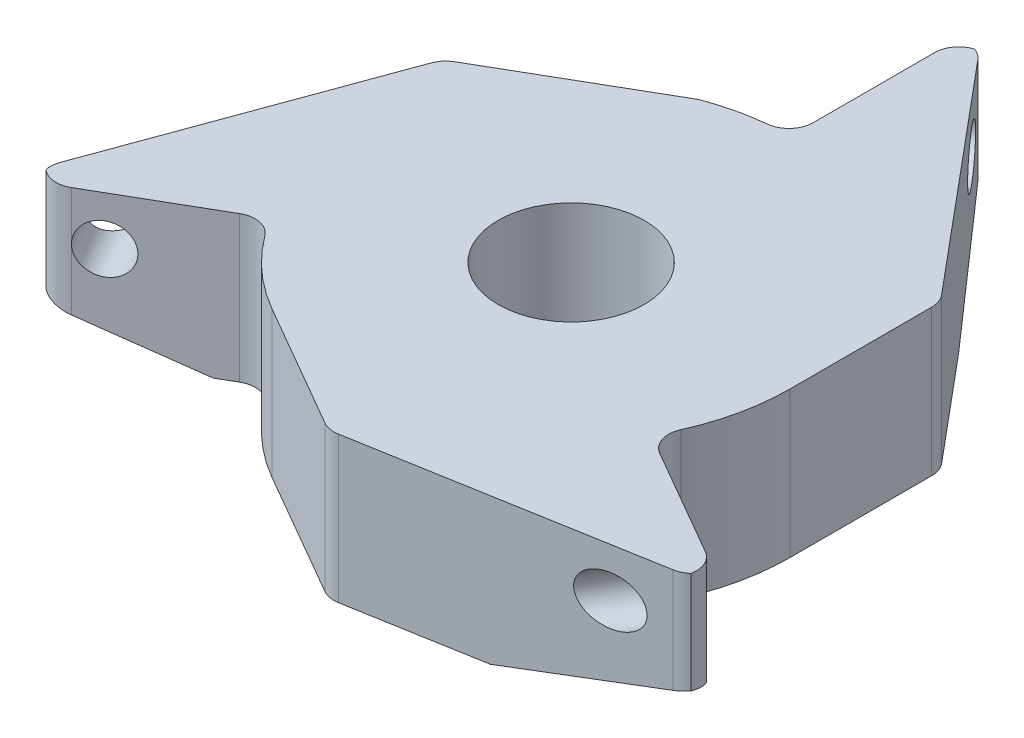
ISO-10303-21;
HEADER;
FILE_DESCRIPTION(('STEP AP214'),'2;1');
FILE_NAME('part.step','',(''),(''),'','','');
FILE_SCHEMA(('AUTOMOTIVE_DESIGN { 1 0 10303 214 1 1 1 1 }'));
ENDSEC;
DATA;
#1=APPLICATION_CONTEXT('core data for automotive mechanical design processes');
#2=APPLICATION_PROTOCOL_DEFINITION('international standard','automotive_design',2000,#1);
#3=PRODUCT_CONTEXT('',#1,'mechanical');
#4=PRODUCT('Part','Part','',(#3));
#5=PRODUCT_RELATED_PRODUCT_CATEGORY('part','',(#4));
#6=PRODUCT_DEFINITION_FORMATION('','',#4);
#7=PRODUCT_DEFINITION_CONTEXT('part definition',#1,'design');
#8=PRODUCT_DEFINITION('design','',#6,#7);
#9=PRODUCT_DEFINITION_SHAPE('','',#8);
#10=(LENGTH_UNIT() NAMED_UNIT(*) SI_UNIT(.MILLI.,.METRE.));
#11=(NAMED_UNIT(*) PLANE_ANGLE_UNIT() SI_UNIT($,.RADIAN.));
#12=(NAMED_UNIT(*) SI_UNIT($,.STERADIAN.) SOLID_ANGLE_UNIT());
#13=UNCERTAINTY_MEASURE_WITH_UNIT(LENGTH_MEASURE(1.E-05),#10,'distance_accuracy_value','');
#14=(GEOMETRIC_REPRESENTATION_CONTEXT(3) GLOBAL_UNCERTAINTY_ASSIGNED_CONTEXT((#13)) GLOBAL_UNIT_ASSIGNED_CONTEXT((#10,
#11,#12)) REPRESENTATION_CONTEXT('',''));
#15=CARTESIAN_POINT('',(0.,0.,0.));
#16=DIRECTION('',(0.,0.,1.));
#17=DIRECTION('',(1.,0.,0.));
#18=AXIS2_PLACEMENT_3D('',#15,#16,#17);
#19=CARTESIAN_POINT('',(1.15585107942412,6.,9.90493523888265));
#20=DIRECTION('',(0.,-1.,0.));
#21=DIRECTION('',(0.,0.,-1.));
#22=AXIS2_PLACEMENT_3D('',#19,#20,#21);
#23=PLANE('',#22);
#24=CARTESIAN_POINT('',(1.15585107942412,6.,9.90493523888265));
#25=DIRECTION('',(0.,1.,0.));
#26=DIRECTION('',(0.,0.,-1.));
#27=AXIS2_PLACEMENT_3D('',#24,#25,#26);
#28=CIRCLE('',#27,1.);
#29=CARTESIAN_POINT('',(0.655851079424115,6.,10.7709606426671));
#30=VERTEX_POINT('',#29);
#31=CARTESIAN_POINT('',(1.32807347289461,6.,10.8899933321885));
#32=VERTEX_POINT('',#31);
#33=EDGE_CURVE('E343',#30,#32,#28,.T.);
#34=ORIENTED_EDGE('',*,*,#33,.T.);
#35=DIRECTION('',(0.985058093305819,0.,-0.172222393470493));
#36=VECTOR('',#35,1.);
#37=CARTESIAN_POINT('',(13.0349088668718,6.,8.84323159781235));
#38=LINE('',#37,#36);
#39=CARTESIAN_POINT('',(13.0349088668718,6.,8.84323159781235));
#40=VERTEX_POINT('',#39);
#41=EDGE_CURVE('E346',#32,#40,#38,.T.);
#42=ORIENTED_EDGE('',*,*,#41,.T.);
#43=CARTESIAN_POINT('',(12.8626864734013,6.,7.85817350450654));
#44=DIRECTION('',(0.,1.,0.));
#45=DIRECTION('',(0.,0.,-1.));
#46=AXIS2_PLACEMENT_3D('',#43,#44,#45);
#47=CIRCLE('',#46,0.999999999999999);
#48=CARTESIAN_POINT('',(13.5287104129548,6.,8.60410387119081));
#49=VERTEX_POINT('',#48);
#50=EDGE_CURVE('E349',#40,#49,#47,.T.);
#51=ORIENTED_EDGE('',*,*,#50,.T.);
#52=CARTESIAN_POINT('',(12.5497037961752,6.,8.40027540335109));
#53=DIRECTION('',(0.,1.,0.));
#54=DIRECTION('',(0.,0.,-1.));
#55=AXIS2_PLACEMENT_3D('',#52,#53,#54);
#56=CIRCLE('',#55,1.);
#57=CARTESIAN_POINT('',(13.0497037961752,6.,7.53424999956666));
#58=VERTEX_POINT('',#57);
#59=EDGE_CURVE('E351',#49,#58,#56,.T.);
#60=ORIENTED_EDGE('',*,*,#59,.T.);
#61=DIRECTION('',(-0.866025403784439,0.,-0.5));
#62=VECTOR('',#61,1.);
#63=CARTESIAN_POINT('',(8.61684396980704,6.,4.9749371855331));
#64=LINE('',#63,#62);
#65=CARTESIAN_POINT('',(8.61684396980704,6.,4.9749371855331));
#66=VERTEX_POINT('',#65);
#67=EDGE_CURVE('E353',#58,#66,#64,.T.);
#68=ORIENTED_EDGE('',*,*,#67,.T.);
#69=CARTESIAN_POINT('',(9.11684396980704,6.,4.10891178174866));
#70=DIRECTION('',(0.,-1.,0.));
#71=DIRECTION('',(0.,0.,1.));
#72=AXIS2_PLACEMENT_3D('',#69,#70,#71);
#73=CIRCLE('',#72,0.999999999999998);
#74=CARTESIAN_POINT('',(8.20515957282634,6.,3.6980206035738));
#75=VERTEX_POINT('',#74);
#76=EDGE_CURVE('E355',#66,#75,#73,.T.);
#77=ORIENTED_EDGE('',*,*,#76,.T.);
#78=CARTESIAN_POINT('',(0.,6.,0.));
#79=DIRECTION('',(0.,1.,0.));
#80=DIRECTION('',(0.,0.,1.));
#81=AXIS2_PLACEMENT_3D('',#78,#79,#80);
#82=CIRCLE('',#81,9.);
#83=CARTESIAN_POINT('',(9.,6.,0.));
#84=VERTEX_POINT('',#83);
#85=EDGE_CURVE('E357',#75,#84,#82,.T.);
#86=ORIENTED_EDGE('',*,*,#85,.T.);
#87=DIRECTION('',(0.,0.,-1.));
#88=VECTOR('',#87,1.);
#89=CARTESIAN_POINT('',(9.,6.,-5.81646401894767));
#90=LINE('',#89,#88);
#91=CARTESIAN_POINT('',(9.,6.,-5.81646401894767));
#92=VERTEX_POINT('',#91);
#93=EDGE_CURVE('E359',#84,#92,#90,.T.);
#94=ORIENTED_EDGE('',*,*,#93,.T.);
#95=CARTESIAN_POINT('',(8.,6.,-5.81646401894767));
#96=DIRECTION('',(0.,1.,0.));
#97=DIRECTION('',(0.,0.,-1.));
#98=AXIS2_PLACEMENT_3D('',#95,#96,#97);
#99=CIRCLE('',#98,0.999999999999999);
#100=CARTESIAN_POINT('',(8.76697413627105,6.,-6.45814203344659));
#101=VERTEX_POINT('',#100);
#102=EDGE_CURVE('E361',#92,#101,#99,.T.);
#103=ORIENTED_EDGE('',*,*,#102,.T.);
#104=DIRECTION('',(-0.641678014498915,0.,-0.766974136271054));
#105=VECTOR('',#104,1.);
#106=CARTESIAN_POINT('',(1.14100878181883,6.,-15.5731780153656));
#107=LINE('',#106,#105);
#108=CARTESIAN_POINT('',(1.14100878181883,6.,-15.5731780153656));
#109=VERTEX_POINT('',#108);
#110=EDGE_CURVE('E363',#101,#109,#107,.T.);
#111=ORIENTED_EDGE('',*,*,#110,.T.);
#112=CARTESIAN_POINT('',(0.37403464554778,6.,-14.9315000008667));
#113=DIRECTION('',(0.,1.,0.));
#114=DIRECTION('',(0.,0.,-1.));
#115=AXIS2_PLACEMENT_3D('',#112,#113,#114);
#116=CIRCLE('',#115,1.);
#117=CARTESIAN_POINT('',(0.687017322773891,6.,-15.8812588353907));
#118=VERTEX_POINT('',#117);
#119=EDGE_CURVE('E365',#109,#118,#116,.T.);
#120=ORIENTED_EDGE('',*,*,#119,.T.);
#121=CARTESIAN_POINT('',(1.,6.,-14.9315000008667));
#122=DIRECTION('',(0.,1.,0.));
#123=DIRECTION('',(0.,0.,-1.));
#124=AXIS2_PLACEMENT_3D('',#121,#122,#123);
#125=CIRCLE('',#124,1.);
#126=CARTESIAN_POINT('',(0.,6.,-14.9315000008667));
#127=VERTEX_POINT('',#126);
#128=EDGE_CURVE('E367',#118,#127,#125,.T.);
#129=ORIENTED_EDGE('',*,*,#128,.T.);
#130=DIRECTION('',(0.,0.,1.));
#131=VECTOR('',#130,1.);
#132=CARTESIAN_POINT('',(0.,6.,-9.9498743710662));
#133=LINE('',#132,#131);
#134=CARTESIAN_POINT('',(0.,6.,-9.9498743710662));
#135=VERTEX_POINT('',#134);
#136=EDGE_CURVE('E369',#127,#135,#133,.T.);
#137=ORIENTED_EDGE('',*,*,#136,.T.);
#138=CARTESIAN_POINT('',(-1.,6.,-9.9498743710662));
#139=DIRECTION('',(0.,-1.,0.));
#140=DIRECTION('',(0.,0.,-1.));
#141=AXIS2_PLACEMENT_3D('',#138,#139,#140);
#142=CIRCLE('',#141,1.);
#143=CARTESIAN_POINT('',(-0.9,6.,-8.95488693395958));
#144=VERTEX_POINT('',#143);
#145=EDGE_CURVE('E371',#135,#144,#142,.T.);
#146=ORIENTED_EDGE('',*,*,#145,.T.);
#147=CARTESIAN_POINT('',(0.,6.,0.));
#148=DIRECTION('',(0.,1.,0.));
#149=DIRECTION('',(0.,0.,1.));
#150=AXIS2_PLACEMENT_3D('',#147,#148,#149);
#151=CIRCLE('',#150,9.);
#152=CARTESIAN_POINT('',(-3.17926677950252,6.,-8.41975431617524));
#153=VERTEX_POINT('',#152);
#154=EDGE_CURVE('E373',#144,#153,#151,.T.);
#155=ORIENTED_EDGE('',*,*,#154,.T.);
#156=DIRECTION('',(-0.866025403784439,0.,0.499999999999999));
#157=VECTOR('',#156,1.);
#158=CARTESIAN_POINT('',(-9.53720560060681,6.,-4.74899662631952));
#159=LINE('',#158,#157);
#160=CARTESIAN_POINT('',(-9.53720560060681,6.,-4.74899662631952));
#161=VERTEX_POINT('',#160);
#162=EDGE_CURVE('E375',#153,#161,#159,.T.);
#163=ORIENTED_EDGE('',*,*,#162,.T.);
#164=CARTESIAN_POINT('',(-9.03720560060681,6.,-3.88297122253508));
#165=DIRECTION('',(0.,1.,0.));
#166=DIRECTION('',(0.,0.,1.));
#167=AXIS2_PLACEMENT_3D('',#164,#165,#166);
#168=CIRCLE('',#167,1.);
#169=CARTESIAN_POINT('',(-9.97640213034836,6.,-4.22635130134199));
#170=VERTEX_POINT('',#169);
#171=EDGE_CURVE('E377',#161,#170,#168,.T.);
#172=ORIENTED_EDGE('',*,*,#171,.T.);
#173=DIRECTION('',(-0.343380078806903,0.,0.939196529741547));
#174=VECTOR('',#173,1.);
#175=CARTESIAN_POINT('',(-14.0572721698734,6.,6.93544641495316));
#176=LINE('',#175,#174);
#177=CARTESIAN_POINT('',(-14.0572721698734,6.,6.93544641495316));
#178=VERTEX_POINT('',#177);
#179=EDGE_CURVE('E379',#170,#178,#176,.T.);
#180=ORIENTED_EDGE('',*,*,#179,.T.);
#181=CARTESIAN_POINT('',(-13.1180756401318,6.,7.27882649376006));
#182=DIRECTION('',(0.,1.,0.));
#183=DIRECTION('',(0.,0.,1.));
#184=AXIS2_PLACEMENT_3D('',#181,#182,#183);
#185=CIRCLE('',#184,1.);
#186=CARTESIAN_POINT('',(-14.0970822569114,6.,7.48265496159978));
#187=VERTEX_POINT('',#186);
#188=EDGE_CURVE('E381',#178,#187,#185,.T.);
#189=ORIENTED_EDGE('',*,*,#188,.T.);
#190=CARTESIAN_POINT('',(-13.4310583173579,6.,6.73672459491551));
#191=DIRECTION('',(0.,1.,0.));
#192=DIRECTION('',(0.,0.,-1.));
#193=AXIS2_PLACEMENT_3D('',#190,#191,#192);
#194=CIRCLE('',#193,1.);
#195=CARTESIAN_POINT('',(-12.9310583173579,6.,7.60274999869994));
#196=VERTEX_POINT('',#195);
#197=EDGE_CURVE('E383',#187,#196,#194,.T.);
#198=ORIENTED_EDGE('',*,*,#197,.T.);
#199=DIRECTION('',(0.866025403784439,0.,-0.5));
#200=VECTOR('',#199,1.);
#201=CARTESIAN_POINT('',(-8.54657490229853,6.,5.07136731875795));
#202=LINE('',#201,#200);
#203=CARTESIAN_POINT('',(-8.54657490229853,6.,5.07136731875795));
#204=VERTEX_POINT('',#203);
#205=EDGE_CURVE('E385',#196,#204,#202,.T.);
#206=ORIENTED_EDGE('',*,*,#205,.T.);
#207=CARTESIAN_POINT('',(-8.04657490229853,6.,5.93739272254239));
#208=DIRECTION('',(0.,-1.,0.));
#209=DIRECTION('',(0.,0.,1.));
#210=AXIS2_PLACEMENT_3D('',#207,#208,#209);
#211=CIRCLE('',#210,0.999999999999999);
#212=CARTESIAN_POINT('',(-7.24191741206868,6.,5.34365345028815));
#213=VERTEX_POINT('',#212);
#214=EDGE_CURVE('E387',#204,#213,#211,.T.);
#215=ORIENTED_EDGE('',*,*,#214,.T.);
#216=CARTESIAN_POINT('',(0.,6.,0.));
#217=DIRECTION('',(0.,1.,0.));
#218=DIRECTION('',(0.,0.,1.));
#219=AXIS2_PLACEMENT_3D('',#216,#217,#218);
#220=CIRCLE('',#219,9.);
#221=CARTESIAN_POINT('',(-4.50000000000001,6.,7.79422863405994));
#222=VERTEX_POINT('',#221);
#223=EDGE_CURVE('E389',#213,#222,#220,.T.);
#224=ORIENTED_EDGE('',*,*,#223,.T.);
#225=DIRECTION('',(0.866025403784439,0.,0.5));
#226=VECTOR('',#225,1.);
#227=CARTESIAN_POINT('',(0.655851079424115,6.,10.7709606426671));
#228=LINE('',#227,#226);
#229=EDGE_CURVE('E391',#222,#30,#228,.T.);
#230=ORIENTED_EDGE('',*,*,#229,.T.);
#231=EDGE_LOOP('',(#34,#42,#51,#60,#68,#77,#86,#94,#103,#111,#120,#129,#137,#146,#155,#163,#172,
#180,#189,#198,#206,#215,#224,#230));
#232=FACE_BOUND('',#231,.T.);
#233=CARTESIAN_POINT('',(0.,6.,0.));
#234=DIRECTION('',(0.,1.,0.));
#235=DIRECTION('',(0.,0.,1.));
#236=AXIS2_PLACEMENT_3D('',#233,#234,#235);
#237=CIRCLE('',#236,3.);
#238=CARTESIAN_POINT('',(0.,6.,3.));
#239=VERTEX_POINT('',#238);
#240=EDGE_CURVE('E337',#239,#239,#237,.T.);
#241=ORIENTED_EDGE('',*,*,#240,.F.);
#242=EDGE_LOOP('',(#241));
#243=FACE_BOUND('',#242,.T.);
#244=ADVANCED_FACE('F38',(#232,#243),#23,.F.);
#245=CARTESIAN_POINT('',(1.15585107942412,0.,9.90493523888265));
#246=DIRECTION('',(0.,-1.,0.));
#247=DIRECTION('',(0.,0.,-1.));
#248=AXIS2_PLACEMENT_3D('',#245,#246,#247);
#249=PLANE('',#248);
#250=DIRECTION('',(0.499999999999996,0.,-0.866025403784441));
#251=VECTOR('',#250,1.);
#252=CARTESIAN_POINT('',(5.29382364628165,0.,12.2939948142571));
#253=LINE('',#252,#251);
#254=CARTESIAN_POINT('',(6.64068393269008,0.,9.9611643675009));
#255=VERTEX_POINT('',#254);
#256=CARTESIAN_POINT('',(9.2938236462816,0.,5.36579158398159));
#257=VERTEX_POINT('',#256);
#258=EDGE_CURVE('E53',#255,#257,#253,.T.);
#259=ORIENTED_EDGE('',*,*,#258,.F.);
#260=DIRECTION('',(0.985058093305819,0.,-0.172222393470493));
#261=VECTOR('',#260,1.);
#262=CARTESIAN_POINT('',(13.0349088668718,0.,8.84323159781235));
#263=LINE('',#262,#261);
#264=CARTESIAN_POINT('',(1.32807347289461,0.,10.8899933321885));
#265=VERTEX_POINT('',#264);
#266=EDGE_CURVE('E396',#265,#255,#263,.T.);
#267=ORIENTED_EDGE('',*,*,#266,.F.);
#268=CARTESIAN_POINT('',(1.15585107942412,0.,9.90493523888265));
#269=DIRECTION('',(0.,1.,0.));
#270=DIRECTION('',(0.,0.,-1.));
#271=AXIS2_PLACEMENT_3D('',#268,#269,#270);
#272=CIRCLE('',#271,1.);
#273=CARTESIAN_POINT('',(0.655851079424115,0.,10.7709606426671));
#274=VERTEX_POINT('',#273);
#275=EDGE_CURVE('E340',#274,#265,#272,.T.);
#276=ORIENTED_EDGE('',*,*,#275,.F.);
#277=DIRECTION('',(0.866025403784439,0.,0.5));
#278=VECTOR('',#277,1.);
#279=CARTESIAN_POINT('',(0.655851079424115,0.,10.7709606426671));
#280=LINE('',#279,#278);
#281=CARTESIAN_POINT('',(-4.50000000000001,0.,7.79422863405994));
#282=VERTEX_POINT('',#281);
#283=EDGE_CURVE('E347',#282,#274,#280,.T.);
#284=ORIENTED_EDGE('',*,*,#283,.F.);
#285=CARTESIAN_POINT('',(0.,0.,0.));
#286=DIRECTION('',(0.,1.,0.));
#287=DIRECTION('',(0.,0.,1.));
#288=AXIS2_PLACEMENT_3D('',#285,#286,#287);
#289=CIRCLE('',#288,9.);
#290=CARTESIAN_POINT('',(-7.24191741206868,0.,5.34365345028815));
#291=VERTEX_POINT('',#290);
#292=EDGE_CURVE('E429',#291,#282,#289,.T.);
#293=ORIENTED_EDGE('',*,*,#292,.F.);
#294=CARTESIAN_POINT('',(-8.04657490229853,0.,5.93739272254239));
#295=DIRECTION('',(0.,-1.,0.));
#296=DIRECTION('',(0.,0.,1.));
#297=AXIS2_PLACEMENT_3D('',#294,#295,#296);
#298=CIRCLE('',#297,0.999999999999999);
#299=CARTESIAN_POINT('',(-8.54657490229853,0.,5.07136731875795));
#300=VERTEX_POINT('',#299);
#301=EDGE_CURVE('E427',#300,#291,#298,.T.);
#302=ORIENTED_EDGE('',*,*,#301,.F.);
#303=DIRECTION('',(0.866025403784439,0.,-0.5));
#304=VECTOR('',#303,1.);
#305=CARTESIAN_POINT('',(-8.54657490229853,0.,5.07136731875795));
#306=LINE('',#305,#304);
#307=CARTESIAN_POINT('',(-9.23450090687295,0.,5.46854158268154));
#308=VERTEX_POINT('',#307);
#309=EDGE_CURVE('E425',#308,#300,#306,.T.);
#310=ORIENTED_EDGE('',*,*,#309,.F.);
#311=DIRECTION('',(0.5,0.,0.866025403784439));
#312=VECTOR('',#311,1.);
#313=CARTESIAN_POINT('',(-4.71589810656955,0.,13.2949912120301));
#314=LINE('',#313,#312);
#315=CARTESIAN_POINT('',(-11.8589858449262,0.,0.922800326274021));
#316=VERTEX_POINT('',#315);
#317=EDGE_CURVE('E331',#316,#308,#314,.T.);
#318=ORIENTED_EDGE('',*,*,#317,.F.);
#319=DIRECTION('',(-0.343380078806903,0.,0.939196529741547));
#320=VECTOR('',#319,1.);
#321=CARTESIAN_POINT('',(-14.0572721698734,0.,6.93544641495316));
#322=LINE('',#321,#320);
#323=CARTESIAN_POINT('',(-9.97640213034836,0.,-4.22635130134199));
#324=VERTEX_POINT('',#323);
#325=EDGE_CURVE('E422',#324,#316,#322,.T.);
#326=ORIENTED_EDGE('',*,*,#325,.F.);
#327=CARTESIAN_POINT('',(-9.03720560060681,0.,-3.88297122253508));
#328=DIRECTION('',(0.,1.,0.));
#329=DIRECTION('',(0.,0.,1.));
#330=AXIS2_PLACEMENT_3D('',#327,#328,#329);
#331=CIRCLE('',#330,1.);
#332=CARTESIAN_POINT('',(-9.53720560060681,0.,-4.74899662631952));
#333=VERTEX_POINT('',#332);
#334=EDGE_CURVE('E420',#333,#324,#331,.T.);
#335=ORIENTED_EDGE('',*,*,#334,.F.);
#336=DIRECTION('',(-0.866025403784439,0.,0.499999999999999));
#337=VECTOR('',#336,1.);
#338=CARTESIAN_POINT('',(-9.53720560060681,0.,-4.74899662631952));
#339=LINE('',#338,#337);
#340=CARTESIAN_POINT('',(-3.17926677950252,0.,-8.41975431617524));
#341=VERTEX_POINT('',#340);
#342=EDGE_CURVE('E418',#341,#333,#339,.T.);
#343=ORIENTED_EDGE('',*,*,#342,.F.);
#344=CARTESIAN_POINT('',(0.,0.,0.));
#345=DIRECTION('',(0.,1.,0.));
#346=DIRECTION('',(0.,0.,1.));
#347=AXIS2_PLACEMENT_3D('',#344,#345,#346);
#348=CIRCLE('',#347,9.);
#349=CARTESIAN_POINT('',(-0.9,0.,-8.95488693395958));
#350=VERTEX_POINT('',#349);
#351=EDGE_CURVE('E416',#350,#341,#348,.T.);
#352=ORIENTED_EDGE('',*,*,#351,.F.);
#353=CARTESIAN_POINT('',(-1.,0.,-9.9498743710662));
#354=DIRECTION('',(0.,-1.,0.));
#355=DIRECTION('',(0.,0.,-1.));
#356=AXIS2_PLACEMENT_3D('',#353,#354,#355);
#357=CIRCLE('',#356,1.);
#358=CARTESIAN_POINT('',(0.,0.,-9.9498743710662));
#359=VERTEX_POINT('',#358);
#360=EDGE_CURVE('E414',#359,#350,#357,.T.);
#361=ORIENTED_EDGE('',*,*,#360,.F.);
#362=DIRECTION('',(0.,0.,1.));
#363=VECTOR('',#362,1.);
#364=CARTESIAN_POINT('',(0.,0.,-9.9498743710662));
#365=LINE('',#364,#363);
#366=CARTESIAN_POINT('',(0.,0.,-10.7315831679632));
#367=VERTEX_POINT('',#366);
#368=EDGE_CURVE('E412',#367,#359,#365,.T.);
#369=ORIENTED_EDGE('',*,*,#368,.F.);
#370=DIRECTION('',(-1.,0.,0.));
#371=VECTOR('',#370,1.);
#372=CARTESIAN_POINT('',(1.15585107942393,0.,-10.7315831679632));
#373=LINE('',#372,#371);
#374=CARTESIAN_POINT('',(5.19166032502993,0.,-10.7315831679632));
#375=VERTEX_POINT('',#374);
#376=EDGE_CURVE('E230',#375,#367,#373,.T.);
#377=ORIENTED_EDGE('',*,*,#376,.F.);
#378=DIRECTION('',(-0.641678014498915,0.,-0.766974136271054));
#379=VECTOR('',#378,1.);
#380=CARTESIAN_POINT('',(1.14100878181883,0.,-15.5731780153656));
#381=LINE('',#380,#379);
#382=CARTESIAN_POINT('',(8.76697413627105,0.,-6.45814203344659));
#383=VERTEX_POINT('',#382);
#384=EDGE_CURVE('E409',#383,#375,#381,.T.);
#385=ORIENTED_EDGE('',*,*,#384,.F.);
#386=CARTESIAN_POINT('',(8.,0.,-5.81646401894767));
#387=DIRECTION('',(0.,1.,0.));
#388=DIRECTION('',(0.,0.,-1.));
#389=AXIS2_PLACEMENT_3D('',#386,#387,#388);
#390=CIRCLE('',#389,0.999999999999999);
#391=CARTESIAN_POINT('',(9.,0.,-5.81646401894767));
#392=VERTEX_POINT('',#391);
#393=EDGE_CURVE('E407',#392,#383,#390,.T.);
#394=ORIENTED_EDGE('',*,*,#393,.F.);
#395=DIRECTION('',(0.,0.,-1.));
#396=VECTOR('',#395,1.);
#397=CARTESIAN_POINT('',(9.,0.,-5.81646401894767));
#398=LINE('',#397,#396);
#399=CARTESIAN_POINT('',(9.,0.,0.));
#400=VERTEX_POINT('',#399);
#401=EDGE_CURVE('E405',#400,#392,#398,.T.);
#402=ORIENTED_EDGE('',*,*,#401,.F.);
#403=CARTESIAN_POINT('',(0.,0.,0.));
#404=DIRECTION('',(0.,1.,0.));
#405=DIRECTION('',(0.,0.,1.));
#406=AXIS2_PLACEMENT_3D('',#403,#404,#405);
#407=CIRCLE('',#406,9.);
#408=CARTESIAN_POINT('',(8.20515957282634,0.,3.6980206035738));
#409=VERTEX_POINT('',#408);
#410=EDGE_CURVE('E403',#409,#400,#407,.T.);
#411=ORIENTED_EDGE('',*,*,#410,.F.);
#412=CARTESIAN_POINT('',(9.11684396980704,0.,4.10891178174866));
#413=DIRECTION('',(0.,-1.,0.));
#414=DIRECTION('',(0.,0.,1.));
#415=AXIS2_PLACEMENT_3D('',#412,#413,#414);
#416=CIRCLE('',#415,0.999999999999998);
#417=CARTESIAN_POINT('',(8.61684396980704,0.,4.9749371855331));
#418=VERTEX_POINT('',#417);
#419=EDGE_CURVE('E401',#418,#409,#416,.T.);
#420=ORIENTED_EDGE('',*,*,#419,.F.);
#421=DIRECTION('',(-0.866025403784439,0.,-0.5));
#422=VECTOR('',#421,1.);
#423=CARTESIAN_POINT('',(8.61684396980704,0.,4.9749371855331));
#424=LINE('',#423,#422);
#425=EDGE_CURVE('E399',#257,#418,#424,.T.);
#426=ORIENTED_EDGE('',*,*,#425,.F.);
#427=EDGE_LOOP('',(#259,#267,#276,#284,#293,#302,#310,#318,#326,#335,#343,#352,#361,#369,#377,
#385,#394,#402,#411,#420,#426));
#428=FACE_BOUND('',#427,.T.);
#429=CARTESIAN_POINT('',(0.,0.,0.));
#430=DIRECTION('',(0.,1.,0.));
#431=DIRECTION('',(0.,0.,1.));
#432=AXIS2_PLACEMENT_3D('',#429,#430,#431);
#433=CIRCLE('',#432,3.);
#434=CARTESIAN_POINT('',(0.,0.,3.));
#435=VERTEX_POINT('',#434);
#436=EDGE_CURVE('E336',#435,#435,#433,.T.);
#437=ORIENTED_EDGE('',*,*,#436,.T.);
#438=EDGE_LOOP('',(#437));
#439=FACE_BOUND('',#438,.T.);
#440=ADVANCED_FACE('F473',(#428,#439),#249,.T.);
#441=CARTESIAN_POINT('',(1.15585107942412,6.,9.90493523888265));
#442=DIRECTION('',(0.,-1.,0.));
#443=DIRECTION('',(0.,0.,-1.));
#444=AXIS2_PLACEMENT_3D('',#441,#442,#443);
#445=CYLINDRICAL_SURFACE('',#444,1.);
#446=ORIENTED_EDGE('',*,*,#275,.T.);
#447=DIRECTION('',(0.,-1.,0.));
#448=VECTOR('',#447,1.);
#449=CARTESIAN_POINT('',(1.32807347289461,6.,10.8899933321885));
#450=LINE('',#449,#448);
#451=EDGE_CURVE('E284',#32,#265,#450,.T.);
#452=ORIENTED_EDGE('',*,*,#451,.F.);
#453=ORIENTED_EDGE('',*,*,#33,.F.);
#454=DIRECTION('',(0.,-1.,0.));
#455=VECTOR('',#454,1.);
#456=CARTESIAN_POINT('',(0.655851079424115,6.,10.7709606426671));
#457=LINE('',#456,#455);
#458=EDGE_CURVE('E393',#30,#274,#457,.T.);
#459=ORIENTED_EDGE('',*,*,#458,.T.);
#460=EDGE_LOOP('',(#446,#452,#453,#459));
#461=FACE_BOUND('',#460,.T.);
#462=ADVANCED_FACE('F40',(#461),#445,.T.);
#463=CARTESIAN_POINT('',(13.0349088668718,6.,8.84323159781235));
#464=DIRECTION('',(-0.172222393470493,0.,-0.985058093305819));
#465=DIRECTION('',(-0.985058093305819,0.,0.172222393470493));
#466=AXIS2_PLACEMENT_3D('',#463,#464,#465);
#467=PLANE('',#466);
#468=CARTESIAN_POINT('',(10.8384531930045,4.,9.22724839425914));
#469=DIRECTION('',(-0.172222393470493,0.,-0.985058093305819));
#470=DIRECTION('',(0.985058093305819,0.,-0.172222393470493));
#471=AXIS2_PLACEMENT_3D('',#468,#469,#470);
#472=ELLIPSE('',#471,1.30382493060573,1.);
#473=CARTESIAN_POINT('',(12.1227964931516,4.,9.00270054404372));
#474=VERTEX_POINT('',#473);
#475=EDGE_CURVE('E291',#474,#474,#472,.T.);
#476=ORIENTED_EDGE('',*,*,#475,.T.);
#477=EDGE_LOOP('',(#476));
#478=FACE_BOUND('',#477,.T.);
#479=ORIENTED_EDGE('',*,*,#266,.T.);
#480=DIRECTION('',(0.95259370790656,0.254612439127245,-0.166546490501923));
#481=VECTOR('',#480,1.);
#482=CARTESIAN_POINT('',(14.0756405321083,1.98724012018014,8.66127552886008));
#483=LINE('',#482,#481);
#484=CARTESIAN_POINT('',(13.0349088668718,1.70906987239933,8.84323159781235));
#485=VERTEX_POINT('',#484);
#486=EDGE_CURVE('E316',#255,#485,#483,.T.);
#487=ORIENTED_EDGE('',*,*,#486,.T.);
#488=DIRECTION('',(0.,-1.,0.));
#489=VECTOR('',#488,1.);
#490=CARTESIAN_POINT('',(13.0349088668718,6.,8.84323159781235));
#491=LINE('',#490,#489);
#492=EDGE_CURVE('E281',#40,#485,#491,.T.);
#493=ORIENTED_EDGE('',*,*,#492,.F.);
#494=ORIENTED_EDGE('',*,*,#41,.F.);
#495=ORIENTED_EDGE('',*,*,#451,.T.);
#496=EDGE_LOOP('',(#479,#487,#493,#494,#495));
#497=FACE_BOUND('',#496,.T.);
#498=ADVANCED_FACE('F535',(#478,#497),#467,.F.);
#499=CARTESIAN_POINT('',(12.8626864734013,6.,7.85817350450654));
#500=DIRECTION('',(0.,-1.,0.));
#501=DIRECTION('',(0.,0.,-1.));
#502=AXIS2_PLACEMENT_3D('',#499,#500,#501);
#503=CYLINDRICAL_SURFACE('',#502,0.999999999999999);
#504=ORIENTED_EDGE('',*,*,#492,.T.);
#505=CARTESIAN_POINT('',(12.8626864734013,1.48879234503332,7.85817350450654));
#506=DIRECTION('',(-0.28118564096977,0.945822136424123,-0.162342605506152));
#507=DIRECTION('',(-0.819105997604964,-0.324685211012307,-0.472911068212058));
#508=AXIS2_PLACEMENT_3D('',#505,#506,#507);
#509=ELLIPSE('',#508,1.05728123871229,0.999999999999999);
#510=CARTESIAN_POINT('',(13.5287104129548,1.81482895987096,8.60410387119081));
#511=VERTEX_POINT('',#510);
#512=EDGE_CURVE('E313',#485,#511,#509,.T.);
#513=ORIENTED_EDGE('',*,*,#512,.T.);
#514=DIRECTION('',(0.,-1.,0.));
#515=VECTOR('',#514,1.);
#516=CARTESIAN_POINT('',(13.5287104129548,6.,8.60410387119081));
#517=LINE('',#516,#515);
#518=EDGE_CURVE('E278',#49,#511,#517,.T.);
#519=ORIENTED_EDGE('',*,*,#518,.F.);
#520=ORIENTED_EDGE('',*,*,#50,.F.);
#521=EDGE_LOOP('',(#504,#513,#519,#520));
#522=FACE_BOUND('',#521,.T.);
#523=ADVANCED_FACE('F532',(#522),#503,.T.);
#524=CARTESIAN_POINT('',(12.5497037961752,6.,8.40027540335109));
#525=DIRECTION('',(0.,-1.,0.));
#526=DIRECTION('',(0.,0.,-1.));
#527=AXIS2_PLACEMENT_3D('',#524,#525,#526);
#528=CYLINDRICAL_SURFACE('',#527,1.);
#529=ORIENTED_EDGE('',*,*,#518,.T.);
#530=CARTESIAN_POINT('',(12.5497037961752,1.48879234503332,8.40027540335109));
#531=DIRECTION('',(-0.28118564096977,0.945822136424123,-0.162342605506152));
#532=DIRECTION('',(-0.819105997604964,-0.324685211012307,-0.472911068212058));
#533=AXIS2_PLACEMENT_3D('',#530,#531,#532);
#534=ELLIPSE('',#533,1.05728123871229,1.);
#535=CARTESIAN_POINT('',(13.0497037961752,1.48879234503332,7.53424999956665));
#536=VERTEX_POINT('',#535);
#537=EDGE_CURVE('E296',#511,#536,#534,.T.);
#538=ORIENTED_EDGE('',*,*,#537,.T.);
#539=DIRECTION('',(0.,-1.,0.));
#540=VECTOR('',#539,1.);
#541=CARTESIAN_POINT('',(13.0497037961752,6.,7.53424999956666));
#542=LINE('',#541,#540);
#543=EDGE_CURVE('E275',#58,#536,#542,.T.);
#544=ORIENTED_EDGE('',*,*,#543,.F.);
#545=ORIENTED_EDGE('',*,*,#59,.F.);
#546=EDGE_LOOP('',(#529,#538,#544,#545));
#547=FACE_BOUND('',#546,.T.);
#548=ADVANCED_FACE('F527',(#547),#528,.T.);
#549=CARTESIAN_POINT('',(8.61684396980704,6.,4.9749371855331));
#550=DIRECTION('',(-0.5,0.,0.866025403784439));
#551=DIRECTION('',(0.866025403784439,0.,0.5));
#552=AXIS2_PLACEMENT_3D('',#549,#550,#551);
#553=PLANE('',#552);
#554=CARTESIAN_POINT('',(12.1243556529821,4.,7.));
#555=DIRECTION('',(-0.5,0.,0.866025403784439));
#556=DIRECTION('',(0.866025403784439,0.,0.5));
#557=AXIS2_PLACEMENT_3D('',#554,#555,#556);
#558=CIRCLE('',#557,1.);
#559=CARTESIAN_POINT('',(12.9903810567666,4.,7.5));
#560=VERTEX_POINT('',#559);
#561=EDGE_CURVE('E289',#560,#560,#558,.T.);
#562=ORIENTED_EDGE('',*,*,#561,.T.);
#563=EDGE_LOOP('',(#562));
#564=FACE_BOUND('',#563,.T.);
#565=ORIENTED_EDGE('',*,*,#543,.T.);
#566=DIRECTION('',(-0.819105997604962,-0.324685211012307,-0.472911068212062));
#567=VECTOR('',#566,1.);
#568=CARTESIAN_POINT('',(10.2839211185253,0.39246447668332,5.93742462610547));
#569=LINE('',#568,#567);
#570=EDGE_CURVE('E11',#536,#257,#569,.T.);
#571=ORIENTED_EDGE('',*,*,#570,.T.);
#572=ORIENTED_EDGE('',*,*,#425,.T.);
#573=DIRECTION('',(0.,-1.,0.));
#574=VECTOR('',#573,1.);
#575=CARTESIAN_POINT('',(8.61684396980704,6.,4.9749371855331));
#576=LINE('',#575,#574);
#577=EDGE_CURVE('E272',#66,#418,#576,.T.);
#578=ORIENTED_EDGE('',*,*,#577,.F.);
#579=ORIENTED_EDGE('',*,*,#67,.F.);
#580=EDGE_LOOP('',(#565,#571,#572,#578,#579));
#581=FACE_BOUND('',#580,.T.);
#582=ADVANCED_FACE('F522',(#564,#581),#553,.F.);
#583=CARTESIAN_POINT('',(9.11684396980704,6.,4.10891178174866));
#584=DIRECTION('',(0.,-1.,0.));
#585=DIRECTION('',(0.,0.,-1.));
#586=AXIS2_PLACEMENT_3D('',#583,#584,#585);
#587=CYLINDRICAL_SURFACE('',#586,0.999999999999998);
#588=ORIENTED_EDGE('',*,*,#419,.T.);
#589=DIRECTION('',(0.,-1.,0.));
#590=VECTOR('',#589,1.);
#591=CARTESIAN_POINT('',(8.20515957282634,6.,3.6980206035738));
#592=LINE('',#591,#590);
#593=EDGE_CURVE('E269',#75,#409,#592,.T.);
#594=ORIENTED_EDGE('',*,*,#593,.F.);
#595=ORIENTED_EDGE('',*,*,#76,.F.);
#596=ORIENTED_EDGE('',*,*,#577,.T.);
#597=EDGE_LOOP('',(#588,#594,#595,#596));
#598=FACE_BOUND('',#597,.T.);
#599=ADVANCED_FACE('F518',(#598),#587,.F.);
#600=CARTESIAN_POINT('',(0.,6.,0.));
#601=DIRECTION('',(0.,-1.,0.));
#602=DIRECTION('',(0.,0.,-1.));
#603=AXIS2_PLACEMENT_3D('',#600,#601,#602);
#604=CYLINDRICAL_SURFACE('',#603,9.);
#605=ORIENTED_EDGE('',*,*,#410,.T.);
#606=DIRECTION('',(0.,-1.,0.));
#607=VECTOR('',#606,1.);
#608=CARTESIAN_POINT('',(9.,6.,0.));
#609=LINE('',#608,#607);
#610=EDGE_CURVE('E266',#84,#400,#609,.T.);
#611=ORIENTED_EDGE('',*,*,#610,.F.);
#612=ORIENTED_EDGE('',*,*,#85,.F.);
#613=ORIENTED_EDGE('',*,*,#593,.T.);
#614=EDGE_LOOP('',(#605,#611,#612,#613));
#615=FACE_BOUND('',#614,.T.);
#616=ADVANCED_FACE('F514',(#615),#604,.T.);
#617=CARTESIAN_POINT('',(9.,6.,-5.81646401894767));
#618=DIRECTION('',(-1.,0.,0.));
#619=DIRECTION('',(0.,0.,1.));
#620=AXIS2_PLACEMENT_3D('',#617,#618,#619);
#621=PLANE('',#620);
#622=ORIENTED_EDGE('',*,*,#401,.T.);
#623=DIRECTION('',(0.,-1.,0.));
#624=VECTOR('',#623,1.);
#625=CARTESIAN_POINT('',(9.,6.,-5.81646401894767));
#626=LINE('',#625,#624);
#627=EDGE_CURVE('E263',#92,#392,#626,.T.);
#628=ORIENTED_EDGE('',*,*,#627,.F.);
#629=ORIENTED_EDGE('',*,*,#93,.F.);
#630=ORIENTED_EDGE('',*,*,#610,.T.);
#631=EDGE_LOOP('',(#622,#628,#629,#630));
#632=FACE_BOUND('',#631,.T.);
#633=ADVANCED_FACE('F509',(#632),#621,.F.);
#634=CARTESIAN_POINT('',(8.,6.,-5.81646401894767));
#635=DIRECTION('',(0.,-1.,0.));
#636=DIRECTION('',(0.,0.,-1.));
#637=AXIS2_PLACEMENT_3D('',#634,#635,#636);
#638=CYLINDRICAL_SURFACE('',#637,0.999999999999999);
#639=ORIENTED_EDGE('',*,*,#393,.T.);
#640=DIRECTION('',(0.,-1.,0.));
#641=VECTOR('',#640,1.);
#642=CARTESIAN_POINT('',(8.76697413627105,6.,-6.45814203344659));
#643=LINE('',#642,#641);
#644=EDGE_CURVE('E260',#101,#383,#643,.T.);
#645=ORIENTED_EDGE('',*,*,#644,.F.);
#646=ORIENTED_EDGE('',*,*,#102,.F.);
#647=ORIENTED_EDGE('',*,*,#627,.T.);
#648=EDGE_LOOP('',(#639,#645,#646,#647));
#649=FACE_BOUND('',#648,.T.);
#650=ADVANCED_FACE('F503',(#649),#638,.T.);
#651=CARTESIAN_POINT('',(1.14100878181883,6.,-15.5731780153656));
#652=DIRECTION('',(-0.766974136271054,0.,0.641678014498915));
#653=DIRECTION('',(0.641678014498915,0.,0.766974136271054));
#654=AXIS2_PLACEMENT_3D('',#651,#652,#653);
#655=PLANE('',#654);
#656=CARTESIAN_POINT('',(2.4571858178022,4.,-14.));
#657=DIRECTION('',(-0.766974136271054,0.,0.641678014498915));
#658=DIRECTION('',(-0.641678014498915,0.,-0.766974136271054));
#659=AXIS2_PLACEMENT_3D('',#656,#657,#658);
#660=ELLIPSE('',#659,1.30382493060573,1.);
#661=CARTESIAN_POINT('',(1.62055002507694,4.,-15.));
#662=VERTEX_POINT('',#661);
#663=EDGE_CURVE('E292',#662,#662,#660,.T.);
#664=ORIENTED_EDGE('',*,*,#663,.T.);
#665=EDGE_LOOP('',(#664));
#666=FACE_BOUND('',#665,.T.);
#667=ORIENTED_EDGE('',*,*,#384,.T.);
#668=DIRECTION('',(-0.620530345639088,0.254612439127246,-0.741697105281333));
#669=VECTOR('',#668,1.);
#670=CARTESIAN_POINT('',(0.455633901939917,1.94325909736472,-16.3923814080944));
#671=LINE('',#670,#669);
#672=CARTESIAN_POINT('',(1.14100878181883,1.66204002224795,-15.5731780153656));
#673=VERTEX_POINT('',#672);
#674=EDGE_CURVE('E494',#375,#673,#671,.T.);
#675=ORIENTED_EDGE('',*,*,#674,.T.);
#676=DIRECTION('',(0.,-1.,0.));
#677=VECTOR('',#676,1.);
#678=CARTESIAN_POINT('',(1.14100878181883,6.,-15.5731780153656));
#679=LINE('',#678,#677);
#680=EDGE_CURVE('E257',#109,#673,#679,.T.);
#681=ORIENTED_EDGE('',*,*,#680,.F.);
#682=ORIENTED_EDGE('',*,*,#110,.F.);
#683=ORIENTED_EDGE('',*,*,#644,.T.);
#684=EDGE_LOOP('',(#667,#675,#681,#682,#683));
#685=FACE_BOUND('',#684,.T.);
#686=ADVANCED_FACE('F497',(#666,#685),#655,.F.);
#687=CARTESIAN_POINT('',(0.37403464554778,6.,-14.9315000008667));
#688=DIRECTION('',(0.,-1.,0.));
#689=DIRECTION('',(0.,0.,-1.));
#690=AXIS2_PLACEMENT_3D('',#687,#688,#689);
#691=CYLINDRICAL_SURFACE('',#690,1.);
#692=ORIENTED_EDGE('',*,*,#680,.T.);
#693=CARTESIAN_POINT('',(0.37403464554778,1.44176249488195,-14.9315000008667));
#694=DIRECTION('',(0.,0.945822136424123,0.324685211012307));
#695=DIRECTION('',(0.,-0.324685211012307,0.945822136424124));
#696=AXIS2_PLACEMENT_3D('',#693,#694,#695);
#697=ELLIPSE('',#696,1.05728123871229,1.);
#698=CARTESIAN_POINT('',(0.687017322773891,1.76779910971959,-15.8812588353907));
#699=VERTEX_POINT('',#698);
#700=EDGE_CURVE('E244',#673,#699,#697,.T.);
#701=ORIENTED_EDGE('',*,*,#700,.T.);
#702=DIRECTION('',(0.,-1.,0.));
#703=VECTOR('',#702,1.);
#704=CARTESIAN_POINT('',(0.687017322773891,6.,-15.8812588353907));
#705=LINE('',#704,#703);
#706=EDGE_CURVE('E243',#118,#699,#705,.T.);
#707=ORIENTED_EDGE('',*,*,#706,.F.);
#708=ORIENTED_EDGE('',*,*,#119,.F.);
#709=EDGE_LOOP('',(#692,#701,#707,#708));
#710=FACE_BOUND('',#709,.T.);
#711=ADVANCED_FACE('F746',(#710),#691,.T.);
#712=CARTESIAN_POINT('',(1.,6.,-14.9315000008667));
#713=DIRECTION('',(0.,-1.,0.));
#714=DIRECTION('',(0.,0.,-1.));
#715=AXIS2_PLACEMENT_3D('',#712,#713,#714);
#716=CYLINDRICAL_SURFACE('',#715,1.);
#717=DIRECTION('',(0.,-1.,0.));
#718=VECTOR('',#717,1.);
#719=CARTESIAN_POINT('',(0.,6.,-14.9315000008667));
#720=LINE('',#719,#718);
#721=CARTESIAN_POINT('',(0.,3.63625867929897,-14.9315000008667));
#722=VERTEX_POINT('',#721);
#723=CARTESIAN_POINT('',(0.,1.44176249488195,-14.9315000008667));
#724=VERTEX_POINT('',#723);
#725=EDGE_CURVE('E240',#722,#724,#720,.T.);
#726=ORIENTED_EDGE('',*,*,#725,.F.);
#727=CARTESIAN_POINT('',(0.,3.63625867929897,-14.9315000008667));
#728=CARTESIAN_POINT('',(7.15977753469996E-06,3.66241964091892,-14.9417184588163));
#729=CARTESIAN_POINT('',(0.000156869744428357,3.68901090691601,-14.9508290142109));
#730=CARTESIAN_POINT('',(0.000588876667822185,3.74286447694799,-14.9667826306545));
#731=CARTESIAN_POINT('',(0.00087117448738768,3.77012678534987,-14.9736256769428));
#732=CARTESIAN_POINT('',(0.00141615790004762,3.82516466274501,-14.9849990929456));
#733=CARTESIAN_POINT('',(0.001678820189558,3.85294079428727,-14.9895267508104));
#734=CARTESIAN_POINT('',(0.00209184546883058,3.9087681028958,-14.9962268467459));
#735=CARTESIAN_POINT('',(0.00224221601779095,3.93681926131915,-14.9983994433577));
#736=CARTESIAN_POINT('',(0.00243602687133536,4.02112851804881,-15.001354882893));
#737=CARTESIAN_POINT('',(0.00222227503516274,4.07754983122964,-14.9985769039902));
#738=CARTESIAN_POINT('',(0.00133063607377098,4.1889888755672,-14.9835828127794));
#739=CARTESIAN_POINT('',(0.0006539333124463,4.24400981760887,-14.9713907741737));
#740=CARTESIAN_POINT('',(0.000189064612379627,4.30871878498658,-14.9512257473349));
#741=CARTESIAN_POINT('',(0.000121527226121086,4.31982559417976,-14.9475488723879));
#742=CARTESIAN_POINT('',(2.68360642058714E-05,4.34189226948983,-14.9398115780643));
#743=CARTESIAN_POINT('',(-3.58797305601817E-07,4.35285227382455,-14.9357515533869));
#744=CARTESIAN_POINT('',(0.,4.36374132070103,-14.9315000008667));
#745=B_SPLINE_CURVE_WITH_KNOTS('',3,(#727,#728,#729,#730,#731,#732,#733,#734,#735,#736,#737,
#738,#739,#740,#741,#742,#743,#744),.UNSPECIFIED.,.F.,.F.,(4,2,2,2,2,2,2,2,4),(0.,
0.0842287159798001,0.168457980244304,0.25278567159856,0.337107685712401,0.505729238224277,
0.673921012742093,0.70901668441447,0.744076589164202),.UNSPECIFIED.);
#746=CARTESIAN_POINT('',(0.,4.36374132070103,-14.9315000008667));
#747=VERTEX_POINT('',#746);
#748=EDGE_CURVE('E59',#722,#747,#745,.T.);
#749=ORIENTED_EDGE('',*,*,#748,.T.);
#750=EDGE_CURVE('E248',#127,#747,#720,.T.);
#751=ORIENTED_EDGE('',*,*,#750,.F.);
#752=ORIENTED_EDGE('',*,*,#128,.F.);
#753=ORIENTED_EDGE('',*,*,#706,.T.);
#754=CARTESIAN_POINT('',(1.,1.44176249488195,-14.9315000008667));
#755=DIRECTION('',(0.,0.945822136424123,0.324685211012307));
#756=DIRECTION('',(0.,-0.324685211012307,0.945822136424124));
#757=AXIS2_PLACEMENT_3D('',#754,#755,#756);
#758=ELLIPSE('',#757,1.05728123871229,1.);
#759=EDGE_CURVE('E227',#699,#724,#758,.T.);
#760=ORIENTED_EDGE('',*,*,#759,.T.);
#761=EDGE_LOOP('',(#726,#749,#751,#752,#753,#760));
#762=FACE_BOUND('',#761,.T.);
#763=ADVANCED_FACE('F239',(#762),#716,.T.);
#764=CARTESIAN_POINT('',(0.,6.,-9.9498743710662));
#765=DIRECTION('',(1.,0.,0.));
#766=DIRECTION('',(0.,0.,-1.));
#767=AXIS2_PLACEMENT_3D('',#764,#765,#766);
#768=PLANE('',#767);
#769=ORIENTED_EDGE('',*,*,#750,.T.);
#770=CARTESIAN_POINT('',(0.,4.,-14.));
#771=DIRECTION('',(1.,0.,0.));
#772=DIRECTION('',(0.,0.,-1.));
#773=AXIS2_PLACEMENT_3D('',#770,#771,#772);
#774=CIRCLE('',#773,1.);
#775=EDGE_CURVE('E46',#747,#722,#774,.T.);
#776=ORIENTED_EDGE('',*,*,#775,.T.);
#777=ORIENTED_EDGE('',*,*,#725,.T.);
#778=DIRECTION('',(0.,-0.324685211012307,0.945822136424124));
#779=VECTOR('',#778,1.);
#780=CARTESIAN_POINT('',(0.,0.39246447668332,-11.8748492522109));
#781=LINE('',#780,#779);
#782=EDGE_CURVE('E224',#724,#367,#781,.T.);
#783=ORIENTED_EDGE('',*,*,#782,.T.);
#784=ORIENTED_EDGE('',*,*,#368,.T.);
#785=DIRECTION('',(0.,-1.,0.));
#786=VECTOR('',#785,1.);
#787=CARTESIAN_POINT('',(0.,6.,-9.9498743710662));
#788=LINE('',#787,#786);
#789=EDGE_CURVE('E249',#135,#359,#788,.T.);
#790=ORIENTED_EDGE('',*,*,#789,.F.);
#791=ORIENTED_EDGE('',*,*,#136,.F.);
#792=EDGE_LOOP('',(#769,#776,#777,#783,#784,#790,#791));
#793=FACE_BOUND('',#792,.T.);
#794=ADVANCED_FACE('F247',(#793),#768,.F.);
#795=CARTESIAN_POINT('',(-1.,6.,-9.9498743710662));
#796=DIRECTION('',(0.,-1.,0.));
#797=DIRECTION('',(0.,0.,-1.));
#798=AXIS2_PLACEMENT_3D('',#795,#796,#797);
#799=CYLINDRICAL_SURFACE('',#798,1.);
#800=ORIENTED_EDGE('',*,*,#360,.T.);
#801=DIRECTION('',(0.,-1.,0.));
#802=VECTOR('',#801,1.);
#803=CARTESIAN_POINT('',(-0.9,6.,-8.95488693395958));
#804=LINE('',#803,#802);
#805=EDGE_CURVE('E252',#144,#350,#804,.T.);
#806=ORIENTED_EDGE('',*,*,#805,.F.);
#807=ORIENTED_EDGE('',*,*,#145,.F.);
#808=ORIENTED_EDGE('',*,*,#789,.T.);
#809=EDGE_LOOP('',(#800,#806,#807,#808));
#810=FACE_BOUND('',#809,.T.);
#811=ADVANCED_FACE('F491',(#810),#799,.F.);
#812=CARTESIAN_POINT('',(0.,6.,0.));
#813=DIRECTION('',(0.,-1.,0.));
#814=DIRECTION('',(0.,0.,-1.));
#815=AXIS2_PLACEMENT_3D('',#812,#813,#814);
#816=CYLINDRICAL_SURFACE('',#815,9.);
#817=ORIENTED_EDGE('',*,*,#351,.T.);
#818=DIRECTION('',(0.,-1.,0.));
#819=VECTOR('',#818,1.);
#820=CARTESIAN_POINT('',(-3.17926677950252,6.,-8.41975431617524));
#821=LINE('',#820,#819);
#822=EDGE_CURVE('E459',#153,#341,#821,.T.);
#823=ORIENTED_EDGE('',*,*,#822,.F.);
#824=ORIENTED_EDGE('',*,*,#154,.F.);
#825=ORIENTED_EDGE('',*,*,#805,.T.);
#826=EDGE_LOOP('',(#817,#823,#824,#825));
#827=FACE_BOUND('',#826,.T.);
#828=ADVANCED_FACE('F466',(#827),#816,.T.);
#829=CARTESIAN_POINT('',(-9.53720560060681,6.,-4.74899662631952));
#830=DIRECTION('',(0.499999999999999,0.,0.866025403784439));
#831=DIRECTION('',(0.866025403784439,0.,-0.499999999999999));
#832=AXIS2_PLACEMENT_3D('',#829,#830,#831);
#833=PLANE('',#832);
#834=ORIENTED_EDGE('',*,*,#342,.T.);
#835=DIRECTION('',(0.,-1.,0.));
#836=VECTOR('',#835,1.);
#837=CARTESIAN_POINT('',(-9.53720560060681,6.,-4.74899662631952));
#838=LINE('',#837,#836);
#839=EDGE_CURVE('E456',#161,#333,#838,.T.);
#840=ORIENTED_EDGE('',*,*,#839,.F.);
#841=ORIENTED_EDGE('',*,*,#162,.F.);
#842=ORIENTED_EDGE('',*,*,#822,.T.);
#843=EDGE_LOOP('',(#834,#840,#841,#842));
#844=FACE_BOUND('',#843,.T.);
#845=ADVANCED_FACE('F479',(#844),#833,.F.);
#846=CARTESIAN_POINT('',(-9.03720560060681,6.,-3.88297122253508));
#847=DIRECTION('',(0.,-1.,0.));
#848=DIRECTION('',(0.,0.,-1.));
#849=AXIS2_PLACEMENT_3D('',#846,#847,#848);
#850=CYLINDRICAL_SURFACE('',#849,1.);
#851=ORIENTED_EDGE('',*,*,#334,.T.);
#852=DIRECTION('',(0.,-1.,0.));
#853=VECTOR('',#852,1.);
#854=CARTESIAN_POINT('',(-9.97640213034836,6.,-4.22635130134199));
#855=LINE('',#854,#853);
#856=EDGE_CURVE('E453',#170,#324,#855,.T.);
#857=ORIENTED_EDGE('',*,*,#856,.F.);
#858=ORIENTED_EDGE('',*,*,#171,.F.);
#859=ORIENTED_EDGE('',*,*,#839,.T.);
#860=EDGE_LOOP('',(#851,#857,#858,#859));
#861=FACE_BOUND('',#860,.T.);
#862=ADVANCED_FACE('F483',(#861),#850,.T.);
#863=CARTESIAN_POINT('',(-14.0572721698734,6.,6.93544641495316));
#864=DIRECTION('',(0.939196529741547,0.,0.343380078806903));
#865=DIRECTION('',(0.343380078806903,0.,-0.939196529741547));
#866=AXIS2_PLACEMENT_3D('',#863,#864,#865);
#867=PLANE('',#866);
#868=CARTESIAN_POINT('',(-13.3222805980129,4.,4.92513313155259));
#869=DIRECTION('',(0.939196529741547,0.,0.343380078806903));
#870=DIRECTION('',(-0.343380078806903,0.,0.939196529741547));
#871=AXIS2_PLACEMENT_3D('',#868,#869,#870);
#872=ELLIPSE('',#871,1.30382493060574,1.);
#873=CARTESIAN_POINT('',(-13.7699881054347,4.,6.14968098176801));
#874=VERTEX_POINT('',#873);
#875=EDGE_CURVE('E333',#874,#874,#872,.T.);
#876=ORIENTED_EDGE('',*,*,#875,.T.);
#877=EDGE_LOOP('',(#876));
#878=FACE_BOUND('',#877,.T.);
#879=ORIENTED_EDGE('',*,*,#325,.T.);
#880=DIRECTION('',(-0.332063362267472,0.254612439127244,0.908243595783255));
#881=VECTOR('',#880,1.);
#882=CARTESIAN_POINT('',(-14.4220475516548,1.96524960877243,7.93316233922768));
#883=LINE('',#882,#881);
#884=CARTESIAN_POINT('',(-14.0572721698734,1.68555494732364,6.93544641495316));
#885=VERTEX_POINT('',#884);
#886=EDGE_CURVE('E328',#316,#885,#883,.T.);
#887=ORIENTED_EDGE('',*,*,#886,.T.);
#888=DIRECTION('',(0.,-1.,0.));
#889=VECTOR('',#888,1.);
#890=CARTESIAN_POINT('',(-14.0572721698734,6.,6.93544641495316));
#891=LINE('',#890,#889);
#892=EDGE_CURVE('E450',#178,#885,#891,.T.);
#893=ORIENTED_EDGE('',*,*,#892,.F.);
#894=ORIENTED_EDGE('',*,*,#179,.F.);
#895=ORIENTED_EDGE('',*,*,#856,.T.);
#896=EDGE_LOOP('',(#879,#887,#893,#894,#895));
#897=FACE_BOUND('',#896,.T.);
#898=ADVANCED_FACE('F575',(#878,#897),#867,.F.);
#899=CARTESIAN_POINT('',(-13.1180756401318,6.,7.27882649376006));
#900=DIRECTION('',(0.,-1.,0.));
#901=DIRECTION('',(0.,0.,-1.));
#902=AXIS2_PLACEMENT_3D('',#899,#900,#901);
#903=CYLINDRICAL_SURFACE('',#902,1.);
#904=ORIENTED_EDGE('',*,*,#892,.T.);
#905=CARTESIAN_POINT('',(-13.1180756401318,1.46527741995764,7.27882649376006));
#906=DIRECTION('',(0.281185640969769,0.945822136424124,-0.162342605506154));
#907=DIRECTION('',(0.819105997604962,-0.324685211012307,-0.472911068212062));
#908=AXIS2_PLACEMENT_3D('',#905,#906,#907);
#909=ELLIPSE('',#908,1.05728123871229,1.);
#910=CARTESIAN_POINT('',(-14.0970822569114,1.79131403479527,7.48265496159978));
#911=VERTEX_POINT('',#910);
#912=EDGE_CURVE('E325',#885,#911,#909,.T.);
#913=ORIENTED_EDGE('',*,*,#912,.T.);
#914=DIRECTION('',(0.,-1.,0.));
#915=VECTOR('',#914,1.);
#916=CARTESIAN_POINT('',(-14.0970822569114,6.,7.48265496159978));
#917=LINE('',#916,#915);
#918=EDGE_CURVE('E447',#187,#911,#917,.T.);
#919=ORIENTED_EDGE('',*,*,#918,.F.);
#920=ORIENTED_EDGE('',*,*,#188,.F.);
#921=EDGE_LOOP('',(#904,#913,#919,#920));
#922=FACE_BOUND('',#921,.T.);
#923=ADVANCED_FACE('F573',(#922),#903,.T.);
#924=CARTESIAN_POINT('',(-13.4310583173579,6.,6.73672459491551));
#925=DIRECTION('',(0.,-1.,0.));
#926=DIRECTION('',(0.,0.,-1.));
#927=AXIS2_PLACEMENT_3D('',#924,#925,#926);
#928=CYLINDRICAL_SURFACE('',#927,1.);
#929=ORIENTED_EDGE('',*,*,#918,.T.);
#930=CARTESIAN_POINT('',(-13.4310583173579,1.46527741995763,6.73672459491551));
#931=DIRECTION('',(0.281185640969769,0.945822136424124,-0.162342605506154));
#932=DIRECTION('',(0.819105997604962,-0.324685211012307,-0.472911068212062));
#933=AXIS2_PLACEMENT_3D('',#930,#931,#932);
#934=ELLIPSE('',#933,1.05728123871229,1.);
#935=CARTESIAN_POINT('',(-12.9310583173579,1.46527741995763,7.60274999869995));
#936=VERTEX_POINT('',#935);
#937=EDGE_CURVE('E322',#911,#936,#934,.T.);
#938=ORIENTED_EDGE('',*,*,#937,.T.);
#939=DIRECTION('',(0.,-1.,0.));
#940=VECTOR('',#939,1.);
#941=CARTESIAN_POINT('',(-12.9310583173579,6.,7.60274999869994));
#942=LINE('',#941,#940);
#943=CARTESIAN_POINT('',(-12.9310583173579,4.,7.60274999869994));
#944=VERTEX_POINT('',#943);
#945=EDGE_CURVE('E443',#944,#936,#942,.T.);
#946=ORIENTED_EDGE('',*,*,#945,.F.);
#947=EDGE_CURVE('E444',#196,#944,#942,.T.);
#948=ORIENTED_EDGE('',*,*,#947,.F.);
#949=ORIENTED_EDGE('',*,*,#197,.F.);
#950=EDGE_LOOP('',(#929,#938,#946,#948,#949));
#951=FACE_BOUND('',#950,.T.);
#952=ADVANCED_FACE('F567',(#951),#928,.T.);
#953=CARTESIAN_POINT('',(-8.54657490229853,6.,5.07136731875795));
#954=DIRECTION('',(-0.5,0.,-0.866025403784439));
#955=DIRECTION('',(-0.866025403784439,0.,0.5));
#956=AXIS2_PLACEMENT_3D('',#953,#954,#955);
#957=PLANE('',#956);
#958=ORIENTED_EDGE('',*,*,#947,.T.);
#959=CARTESIAN_POINT('',(-12.0650329135735,4.,7.10274999869995));
#960=DIRECTION('',(0.5,0.,0.866025403784439));
#961=DIRECTION('',(0.866025403784439,0.,-0.5));
#962=AXIS2_PLACEMENT_3D('',#959,#960,#961);
#963=CIRCLE('',#962,1.);
#964=EDGE_CURVE('E320',#944,#944,#963,.T.);
#965=ORIENTED_EDGE('',*,*,#964,.F.);
#966=ORIENTED_EDGE('',*,*,#945,.T.);
#967=DIRECTION('',(0.819105997604962,-0.324685211012307,-0.472911068212061));
#968=VECTOR('',#967,1.);
#969=CARTESIAN_POINT('',(-10.2148060182477,0.388582885333322,6.03452100262174));
#970=LINE('',#969,#968);
#971=EDGE_CURVE('E234',#936,#308,#970,.T.);
#972=ORIENTED_EDGE('',*,*,#971,.T.);
#973=ORIENTED_EDGE('',*,*,#309,.T.);
#974=DIRECTION('',(0.,-1.,0.));
#975=VECTOR('',#974,1.);
#976=CARTESIAN_POINT('',(-8.54657490229853,6.,5.07136731875795));
#977=LINE('',#976,#975);
#978=EDGE_CURVE('E440',#204,#300,#977,.T.);
#979=ORIENTED_EDGE('',*,*,#978,.F.);
#980=ORIENTED_EDGE('',*,*,#205,.F.);
#981=EDGE_LOOP('',(#958,#965,#966,#972,#973,#979,#980));
#982=FACE_BOUND('',#981,.T.);
#983=ADVANCED_FACE('F560',(#982),#957,.F.);
#984=CARTESIAN_POINT('',(-8.04657490229853,6.,5.93739272254239));
#985=DIRECTION('',(0.,-1.,0.));
#986=DIRECTION('',(0.,0.,-1.));
#987=AXIS2_PLACEMENT_3D('',#984,#985,#986);
#988=CYLINDRICAL_SURFACE('',#987,0.999999999999999);
#989=ORIENTED_EDGE('',*,*,#301,.T.);
#990=DIRECTION('',(0.,-1.,0.));
#991=VECTOR('',#990,1.);
#992=CARTESIAN_POINT('',(-7.24191741206868,6.,5.34365345028815));
#993=LINE('',#992,#991);
#994=EDGE_CURVE('E437',#213,#291,#993,.T.);
#995=ORIENTED_EDGE('',*,*,#994,.F.);
#996=ORIENTED_EDGE('',*,*,#214,.F.);
#997=ORIENTED_EDGE('',*,*,#978,.T.);
#998=EDGE_LOOP('',(#989,#995,#996,#997));
#999=FACE_BOUND('',#998,.T.);
#1000=ADVANCED_FACE('F555',(#999),#988,.F.);
#1001=CARTESIAN_POINT('',(0.,6.,0.));
#1002=DIRECTION('',(0.,-1.,0.));
#1003=DIRECTION('',(0.,0.,-1.));
#1004=AXIS2_PLACEMENT_3D('',#1001,#1002,#1003);
#1005=CYLINDRICAL_SURFACE('',#1004,9.);
#1006=ORIENTED_EDGE('',*,*,#292,.T.);
#1007=DIRECTION('',(0.,-1.,0.));
#1008=VECTOR('',#1007,1.);
#1009=CARTESIAN_POINT('',(-4.50000000000001,6.,7.79422863405994));
#1010=LINE('',#1009,#1008);
#1011=EDGE_CURVE('E434',#222,#282,#1010,.T.);
#1012=ORIENTED_EDGE('',*,*,#1011,.F.);
#1013=ORIENTED_EDGE('',*,*,#223,.F.);
#1014=ORIENTED_EDGE('',*,*,#994,.T.);
#1015=EDGE_LOOP('',(#1006,#1012,#1013,#1014));
#1016=FACE_BOUND('',#1015,.T.);
#1017=ADVANCED_FACE('F549',(#1016),#1005,.T.);
#1018=CARTESIAN_POINT('',(0.655851079424115,6.,10.7709606426671));
#1019=DIRECTION('',(0.5,0.,-0.866025403784438));
#1020=DIRECTION('',(-0.866025403784439,0.,-0.5));
#1021=AXIS2_PLACEMENT_3D('',#1018,#1019,#1020);
#1022=PLANE('',#1021);
#1023=ORIENTED_EDGE('',*,*,#283,.T.);
#1024=ORIENTED_EDGE('',*,*,#458,.F.);
#1025=ORIENTED_EDGE('',*,*,#229,.F.);
#1026=ORIENTED_EDGE('',*,*,#1011,.T.);
#1027=EDGE_LOOP('',(#1023,#1024,#1025,#1026));
#1028=FACE_BOUND('',#1027,.T.);
#1029=ADVANCED_FACE('F545',(#1028),#1022,.F.);
#1030=CARTESIAN_POINT('',(0.,6.,0.));
#1031=DIRECTION('',(0.,-1.,0.));
#1032=DIRECTION('',(0.,0.,-1.));
#1033=AXIS2_PLACEMENT_3D('',#1030,#1031,#1032);
#1034=CYLINDRICAL_SURFACE('',#1033,3.);
#1035=ORIENTED_EDGE('',*,*,#240,.T.);
#1036=EDGE_LOOP('',(#1035));
#1037=FACE_BOUND('',#1036,.T.);
#1038=ORIENTED_EDGE('',*,*,#436,.F.);
#1039=EDGE_LOOP('',(#1038));
#1040=FACE_BOUND('',#1039,.T.);
#1041=ADVANCED_FACE('F592',(#1037,#1040),#1034,.F.);
#1042=CARTESIAN_POINT('',(-24.5517184014273,1.9231201067871,-9.85739237852837));
#1043=DIRECTION('',(0.281185640969769,0.945822136424124,-0.162342605506154));
#1044=DIRECTION('',(-0.958537663973848,0.28496586943625,0.));
#1045=AXIS2_PLACEMENT_3D('',#1042,#1043,#1044);
#1046=PLANE('',#1045);
#1047=ORIENTED_EDGE('',*,*,#317,.T.);
#1048=ORIENTED_EDGE('',*,*,#971,.F.);
#1049=ORIENTED_EDGE('',*,*,#937,.F.);
#1050=ORIENTED_EDGE('',*,*,#912,.F.);
#1051=ORIENTED_EDGE('',*,*,#886,.F.);
#1052=EDGE_LOOP('',(#1047,#1048,#1049,#1050,#1051));
#1053=FACE_BOUND('',#1052,.T.);
#1054=ADVANCED_FACE('F565',(#1053),#1046,.F.);
#1055=CARTESIAN_POINT('',(-22.5306613607773,4.,-11.0242502049952));
#1056=DIRECTION('',(0.5,0.,0.866025403784439));
#1057=DIRECTION('',(0.866025403784439,0.,-0.5));
#1058=AXIS2_PLACEMENT_3D('',#1055,#1056,#1057);
#1059=CYLINDRICAL_SURFACE('',#1058,1.);
#1060=ORIENTED_EDGE('',*,*,#964,.T.);
#1061=EDGE_LOOP('',(#1060));
#1062=FACE_BOUND('',#1061,.T.);
#1063=ORIENTED_EDGE('',*,*,#875,.F.);
#1064=EDGE_LOOP('',(#1063));
#1065=FACE_BOUND('',#1064,.T.);
#1066=ADVANCED_FACE('F637',(#1062,#1065),#1059,.F.);
#1067=CARTESIAN_POINT('',(13.5497037961752,1.9231201067871,-16.3337156529339));
#1068=DIRECTION('',(0.,0.945822136424123,0.324685211012307));
#1069=DIRECTION('',(0.,-0.324685211012307,0.945822136424124));
#1070=AXIS2_PLACEMENT_3D('',#1067,#1068,#1069);
#1071=PLANE('',#1070);
#1072=ORIENTED_EDGE('',*,*,#376,.T.);
#1073=ORIENTED_EDGE('',*,*,#782,.F.);
#1074=ORIENTED_EDGE('',*,*,#759,.F.);
#1075=ORIENTED_EDGE('',*,*,#700,.F.);
#1076=ORIENTED_EDGE('',*,*,#674,.F.);
#1077=EDGE_LOOP('',(#1072,#1073,#1074,#1075,#1076));
#1078=FACE_BOUND('',#1077,.T.);
#1079=ADVANCED_FACE('F226',(#1078),#1071,.F.);
#1080=CARTESIAN_POINT('',(13.5497037961753,4.,-14.0000000000001));
#1081=DIRECTION('',(-1.,0.,0.));
#1082=DIRECTION('',(0.,0.,1.));
#1083=AXIS2_PLACEMENT_3D('',#1080,#1081,#1082);
#1084=CYLINDRICAL_SURFACE('',#1083,1.);
#1085=ORIENTED_EDGE('',*,*,#775,.F.);
#1086=ORIENTED_EDGE('',*,*,#748,.F.);
#1087=EDGE_LOOP('',(#1085,#1086));
#1088=FACE_BOUND('',#1087,.T.);
#1089=ORIENTED_EDGE('',*,*,#663,.F.);
#1090=EDGE_LOOP('',(#1089));
#1091=FACE_BOUND('',#1090,.T.);
#1092=ADVANCED_FACE('F651',(#1088,#1091),#1084,.F.);
#1093=CARTESIAN_POINT('',(3.87286127120105,4.,21.2920075076141));
#1094=DIRECTION('',(0.499999999999996,0.,-0.866025403784441));
#1095=DIRECTION('',(-0.866025403784441,0.,-0.499999999999996));
#1096=AXIS2_PLACEMENT_3D('',#1093,#1094,#1095);
#1097=CYLINDRICAL_SURFACE('',#1096,1.);
#1098=ORIENTED_EDGE('',*,*,#561,.F.);
#1099=EDGE_LOOP('',(#1098));
#1100=FACE_BOUND('',#1099,.T.);
#1101=ORIENTED_EDGE('',*,*,#475,.F.);
#1102=EDGE_LOOP('',(#1101));
#1103=FACE_BOUND('',#1102,.T.);
#1104=ADVANCED_FACE('F659',(#1100,#1103),#1097,.F.);
#1105=CARTESIAN_POINT('',(5.89391831185106,1.9231201067871,22.458865334081));
#1106=DIRECTION('',(-0.28118564096977,0.945822136424123,-0.162342605506152));
#1107=DIRECTION('',(-0.958537663973848,-0.284965869436251,0.));
#1108=AXIS2_PLACEMENT_3D('',#1105,#1106,#1107);
#1109=PLANE('',#1108);
#1110=ORIENTED_EDGE('',*,*,#258,.T.);
#1111=ORIENTED_EDGE('',*,*,#570,.F.);
#1112=ORIENTED_EDGE('',*,*,#537,.F.);
#1113=ORIENTED_EDGE('',*,*,#512,.F.);
#1114=ORIENTED_EDGE('',*,*,#486,.F.);
#1115=EDGE_LOOP('',(#1110,#1111,#1112,#1113,#1114));
#1116=FACE_BOUND('',#1115,.T.);
#1117=ADVANCED_FACE('F525',(#1116),#1109,.F.);
#1118=CLOSED_SHELL('',(#244,#440,#462,#498,#523,#548,#582,#599,#616,#633,#650,#686,#711,#763,
#794,#811,#828,#845,#862,#898,#923,#952,#983,#1000,#1017,#1029,#1041,#1054,#1066,#1079,#1092,
#1104,#1117));
#1119=MANIFOLD_SOLID_BREP('B2',#1118);
#1120=ADVANCED_BREP_SHAPE_REPRESENTATION('',(#18,#1119),#14);
#1121=SHAPE_DEFINITION_REPRESENTATION(#9,#1120);
ENDSEC;
END-ISO-10303-21;
